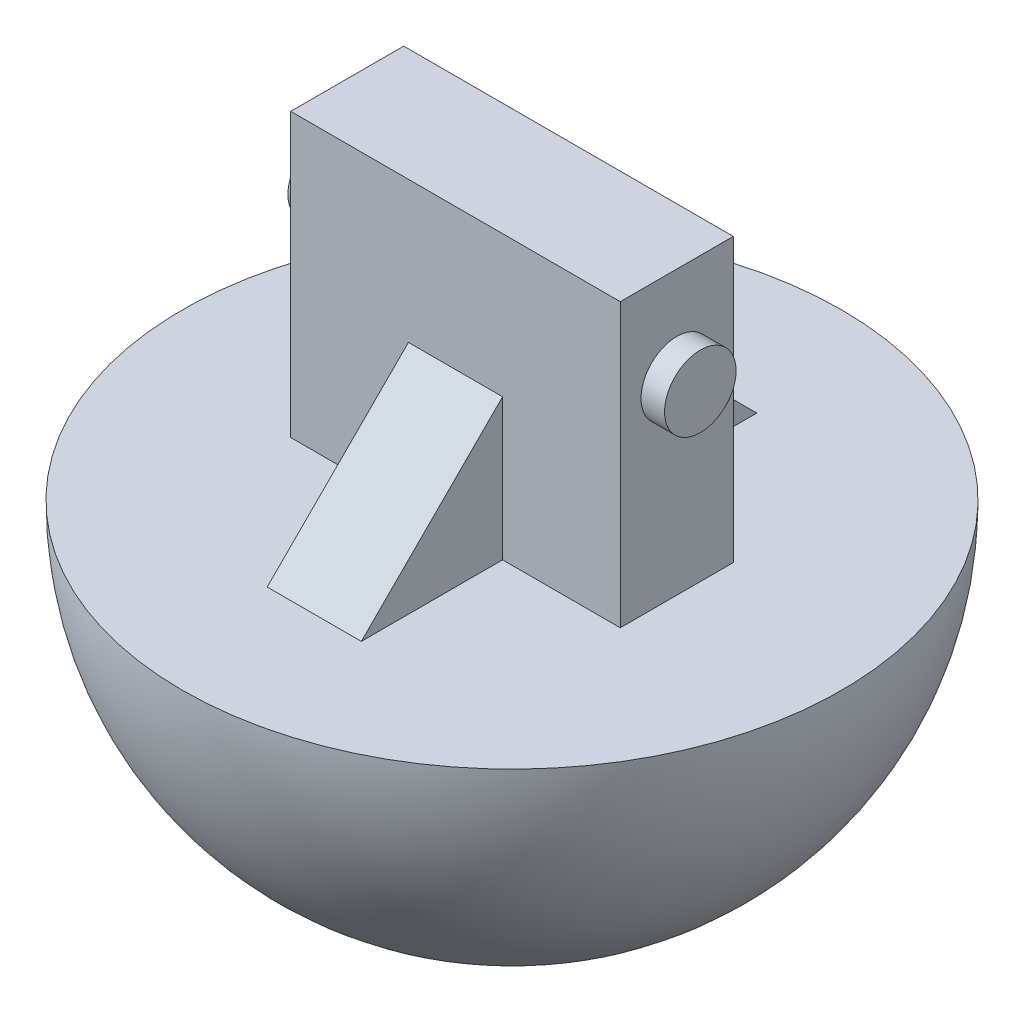
ISO-10303-21;
HEADER;
FILE_DESCRIPTION(('STEP AP214'),'2;1');
FILE_NAME('part.step','',(''),(''),'','','');
FILE_SCHEMA(('AUTOMOTIVE_DESIGN { 1 0 10303 214 1 1 1 1 }'));
ENDSEC;
DATA;
#1=APPLICATION_CONTEXT('core data for automotive mechanical design processes');
#2=APPLICATION_PROTOCOL_DEFINITION('international standard','automotive_design',2000,#1);
#3=PRODUCT_CONTEXT('',#1,'mechanical');
#4=PRODUCT('Part','Part','',(#3));
#5=PRODUCT_RELATED_PRODUCT_CATEGORY('part','',(#4));
#6=PRODUCT_DEFINITION_FORMATION('','',#4);
#7=PRODUCT_DEFINITION_CONTEXT('part definition',#1,'design');
#8=PRODUCT_DEFINITION('design','',#6,#7);
#9=PRODUCT_DEFINITION_SHAPE('','',#8);
#10=(LENGTH_UNIT() NAMED_UNIT(*) SI_UNIT(.MILLI.,.METRE.));
#11=(NAMED_UNIT(*) PLANE_ANGLE_UNIT() SI_UNIT($,.RADIAN.));
#12=(NAMED_UNIT(*) SI_UNIT($,.STERADIAN.) SOLID_ANGLE_UNIT());
#13=UNCERTAINTY_MEASURE_WITH_UNIT(LENGTH_MEASURE(1.E-05),#10,'distance_accuracy_value','');
#14=(GEOMETRIC_REPRESENTATION_CONTEXT(3) GLOBAL_UNCERTAINTY_ASSIGNED_CONTEXT((#13)) GLOBAL_UNIT_ASSIGNED_CONTEXT((#10,
#11,#12)) REPRESENTATION_CONTEXT('',''));
#15=CARTESIAN_POINT('',(0.,0.,0.));
#16=DIRECTION('',(0.,0.,1.));
#17=DIRECTION('',(1.,0.,0.));
#18=AXIS2_PLACEMENT_3D('',#15,#16,#17);
#19=CARTESIAN_POINT('',(0.,-19.05,52.07));
#20=DIRECTION('',(0.,1.,0.));
#21=DIRECTION('',(0.,0.,1.));
#22=AXIS2_PLACEMENT_3D('',#19,#20,#21);
#23=PLANE('',#22);
#24=CARTESIAN_POINT('',(0.,-19.05,7.62));
#25=DIRECTION('',(0.,1.,0.));
#26=DIRECTION('',(0.,0.,1.));
#27=AXIS2_PLACEMENT_3D('',#24,#25,#26);
#28=CIRCLE('',#27,44.45);
#29=CARTESIAN_POINT('',(0.,-19.05,52.07));
#30=VERTEX_POINT('',#29);
#31=EDGE_CURVE('E153',#30,#30,#28,.T.);
#32=ORIENTED_EDGE('',*,*,#31,.T.);
#33=EDGE_LOOP('',(#32));
#34=FACE_BOUND('',#33,.T.);
#35=DIRECTION('',(-1.,0.,0.));
#36=VECTOR('',#35,1.);
#37=CARTESIAN_POINT('',(6.35,-19.05,-19.05));
#38=LINE('',#37,#36);
#39=CARTESIAN_POINT('',(6.35,-19.05,-19.05));
#40=VERTEX_POINT('',#39);
#41=CARTESIAN_POINT('',(-6.35,-19.05,-19.05));
#42=VERTEX_POINT('',#41);
#43=EDGE_CURVE('E48',#40,#42,#38,.T.);
#44=ORIENTED_EDGE('',*,*,#43,.F.);
#45=DIRECTION('',(0.,0.,1.));
#46=VECTOR('',#45,1.);
#47=CARTESIAN_POINT('',(6.35,-19.05,0.));
#48=LINE('',#47,#46);
#49=CARTESIAN_POINT('',(6.35,-19.05,0.));
#50=VERTEX_POINT('',#49);
#51=EDGE_CURVE('E131',#40,#50,#48,.T.);
#52=ORIENTED_EDGE('',*,*,#51,.T.);
#53=DIRECTION('',(1.,0.,0.));
#54=VECTOR('',#53,1.);
#55=CARTESIAN_POINT('',(22.225,-19.05,0.));
#56=LINE('',#55,#54);
#57=CARTESIAN_POINT('',(22.225,-19.05,0.));
#58=VERTEX_POINT('',#57);
#59=EDGE_CURVE('E180',#50,#58,#56,.T.);
#60=ORIENTED_EDGE('',*,*,#59,.T.);
#61=DIRECTION('',(0.,0.,-1.));
#62=VECTOR('',#61,1.);
#63=CARTESIAN_POINT('',(22.225,-19.05,15.24));
#64=LINE('',#63,#62);
#65=CARTESIAN_POINT('',(22.225,-19.05,15.24));
#66=VERTEX_POINT('',#65);
#67=EDGE_CURVE('E191',#66,#58,#64,.T.);
#68=ORIENTED_EDGE('',*,*,#67,.F.);
#69=DIRECTION('',(1.,0.,0.));
#70=VECTOR('',#69,1.);
#71=CARTESIAN_POINT('',(22.225,-19.05,15.24));
#72=LINE('',#71,#70);
#73=CARTESIAN_POINT('',(6.35,-19.05,15.24));
#74=VERTEX_POINT('',#73);
#75=EDGE_CURVE('E168',#74,#66,#72,.T.);
#76=ORIENTED_EDGE('',*,*,#75,.F.);
#77=DIRECTION('',(0.,0.,-1.));
#78=VECTOR('',#77,1.);
#79=CARTESIAN_POINT('',(6.35,-19.05,15.24));
#80=LINE('',#79,#78);
#81=CARTESIAN_POINT('',(6.35,-19.05,34.29));
#82=VERTEX_POINT('',#81);
#83=EDGE_CURVE('E136',#82,#74,#80,.T.);
#84=ORIENTED_EDGE('',*,*,#83,.F.);
#85=DIRECTION('',(-1.,0.,0.));
#86=VECTOR('',#85,1.);
#87=CARTESIAN_POINT('',(6.35,-19.05,34.29));
#88=LINE('',#87,#86);
#89=CARTESIAN_POINT('',(-6.35,-19.05,34.29));
#90=VERTEX_POINT('',#89);
#91=EDGE_CURVE('E151',#82,#90,#88,.T.);
#92=ORIENTED_EDGE('',*,*,#91,.T.);
#93=DIRECTION('',(0.,0.,-1.));
#94=VECTOR('',#93,1.);
#95=CARTESIAN_POINT('',(-6.35,-19.05,15.24));
#96=LINE('',#95,#94);
#97=CARTESIAN_POINT('',(-6.35,-19.05,15.24));
#98=VERTEX_POINT('',#97);
#99=EDGE_CURVE('E146',#90,#98,#96,.T.);
#100=ORIENTED_EDGE('',*,*,#99,.T.);
#101=CARTESIAN_POINT('',(-22.225,-19.05,15.24));
#102=VERTEX_POINT('',#101);
#103=EDGE_CURVE('E170',#102,#98,#72,.T.);
#104=ORIENTED_EDGE('',*,*,#103,.F.);
#105=DIRECTION('',(0.,0.,-1.));
#106=VECTOR('',#105,1.);
#107=CARTESIAN_POINT('',(-22.225,-19.05,15.24));
#108=LINE('',#107,#106);
#109=CARTESIAN_POINT('',(-22.225,-19.05,0.));
#110=VERTEX_POINT('',#109);
#111=EDGE_CURVE('E41',#102,#110,#108,.T.);
#112=ORIENTED_EDGE('',*,*,#111,.T.);
#113=CARTESIAN_POINT('',(-6.35,-19.05,0.));
#114=VERTEX_POINT('',#113);
#115=EDGE_CURVE('E181',#110,#114,#56,.T.);
#116=ORIENTED_EDGE('',*,*,#115,.T.);
#117=DIRECTION('',(0.,0.,1.));
#118=VECTOR('',#117,1.);
#119=CARTESIAN_POINT('',(-6.35,-19.05,0.));
#120=LINE('',#119,#118);
#121=EDGE_CURVE('E53',#42,#114,#120,.T.);
#122=ORIENTED_EDGE('',*,*,#121,.F.);
#123=EDGE_LOOP('',(#44,#52,#60,#68,#76,#84,#92,#100,#104,#112,#116,#122));
#124=FACE_BOUND('',#123,.T.);
#125=ADVANCED_FACE('F33',(#34,#124),#23,.T.);
#126=CARTESIAN_POINT('',(0.,0.,0.));
#127=DIRECTION('',(0.,0.,-1.));
#128=DIRECTION('',(-1.,0.,0.));
#129=AXIS2_PLACEMENT_3D('',#126,#127,#128);
#130=PLANE('',#129);
#131=ORIENTED_EDGE('',*,*,#59,.F.);
#132=DIRECTION('',(0.,1.,0.));
#133=VECTOR('',#132,1.);
#134=CARTESIAN_POINT('',(6.35,0.,0.));
#135=LINE('',#134,#133);
#136=CARTESIAN_POINT('',(6.35,0.,0.));
#137=VERTEX_POINT('',#136);
#138=EDGE_CURVE('E115',#50,#137,#135,.T.);
#139=ORIENTED_EDGE('',*,*,#138,.T.);
#140=DIRECTION('',(-1.,0.,0.));
#141=VECTOR('',#140,1.);
#142=CARTESIAN_POINT('',(6.35,0.,0.));
#143=LINE('',#142,#141);
#144=CARTESIAN_POINT('',(-6.35,0.,0.));
#145=VERTEX_POINT('',#144);
#146=EDGE_CURVE('E108',#137,#145,#143,.T.);
#147=ORIENTED_EDGE('',*,*,#146,.T.);
#148=DIRECTION('',(0.,1.,0.));
#149=VECTOR('',#148,1.);
#150=CARTESIAN_POINT('',(-6.35,0.,0.));
#151=LINE('',#150,#149);
#152=EDGE_CURVE('E113',#114,#145,#151,.T.);
#153=ORIENTED_EDGE('',*,*,#152,.F.);
#154=ORIENTED_EDGE('',*,*,#115,.F.);
#155=DIRECTION('',(0.,-1.,0.));
#156=VECTOR('',#155,1.);
#157=CARTESIAN_POINT('',(-22.225,19.05,0.));
#158=LINE('',#157,#156);
#159=CARTESIAN_POINT('',(-22.225,19.05,0.));
#160=VERTEX_POINT('',#159);
#161=EDGE_CURVE('E165',#160,#110,#158,.T.);
#162=ORIENTED_EDGE('',*,*,#161,.F.);
#163=DIRECTION('',(-1.,0.,0.));
#164=VECTOR('',#163,1.);
#165=CARTESIAN_POINT('',(22.225,19.05,0.));
#166=LINE('',#165,#164);
#167=CARTESIAN_POINT('',(22.225,19.05,0.));
#168=VERTEX_POINT('',#167);
#169=EDGE_CURVE('E169',#168,#160,#166,.T.);
#170=ORIENTED_EDGE('',*,*,#169,.F.);
#171=DIRECTION('',(0.,1.,0.));
#172=VECTOR('',#171,1.);
#173=CARTESIAN_POINT('',(22.225,19.05,0.));
#174=LINE('',#173,#172);
#175=EDGE_CURVE('E183',#58,#168,#174,.T.);
#176=ORIENTED_EDGE('',*,*,#175,.F.);
#177=EDGE_LOOP('',(#131,#139,#147,#153,#154,#162,#170,#176));
#178=FACE_BOUND('',#177,.T.);
#179=ADVANCED_FACE('F111',(#178),#130,.T.);
#180=CARTESIAN_POINT('',(0.,0.,15.24));
#181=DIRECTION('',(0.,0.,-1.));
#182=DIRECTION('',(-1.,0.,0.));
#183=AXIS2_PLACEMENT_3D('',#180,#181,#182);
#184=PLANE('',#183);
#185=DIRECTION('',(0.,1.,0.));
#186=VECTOR('',#185,1.);
#187=CARTESIAN_POINT('',(6.35,0.,15.24));
#188=LINE('',#187,#186);
#189=CARTESIAN_POINT('',(6.35,0.,15.24));
#190=VERTEX_POINT('',#189);
#191=EDGE_CURVE('E140',#74,#190,#188,.T.);
#192=ORIENTED_EDGE('',*,*,#191,.F.);
#193=ORIENTED_EDGE('',*,*,#75,.T.);
#194=DIRECTION('',(0.,1.,0.));
#195=VECTOR('',#194,1.);
#196=CARTESIAN_POINT('',(22.225,19.05,15.24));
#197=LINE('',#196,#195);
#198=CARTESIAN_POINT('',(22.225,19.05,15.24));
#199=VERTEX_POINT('',#198);
#200=EDGE_CURVE('E173',#66,#199,#197,.T.);
#201=ORIENTED_EDGE('',*,*,#200,.T.);
#202=DIRECTION('',(-1.,0.,0.));
#203=VECTOR('',#202,1.);
#204=CARTESIAN_POINT('',(22.225,19.05,15.24));
#205=LINE('',#204,#203);
#206=CARTESIAN_POINT('',(-22.225,19.05,15.24));
#207=VERTEX_POINT('',#206);
#208=EDGE_CURVE('E175',#199,#207,#205,.T.);
#209=ORIENTED_EDGE('',*,*,#208,.T.);
#210=DIRECTION('',(0.,-1.,0.));
#211=VECTOR('',#210,1.);
#212=CARTESIAN_POINT('',(-22.225,19.05,15.24));
#213=LINE('',#212,#211);
#214=EDGE_CURVE('E166',#207,#102,#213,.T.);
#215=ORIENTED_EDGE('',*,*,#214,.T.);
#216=ORIENTED_EDGE('',*,*,#103,.T.);
#217=DIRECTION('',(0.,1.,0.));
#218=VECTOR('',#217,1.);
#219=CARTESIAN_POINT('',(-6.35,0.,15.24));
#220=LINE('',#219,#218);
#221=CARTESIAN_POINT('',(-6.35,0.,15.24));
#222=VERTEX_POINT('',#221);
#223=EDGE_CURVE('E137',#98,#222,#220,.T.);
#224=ORIENTED_EDGE('',*,*,#223,.T.);
#225=DIRECTION('',(-1.,0.,0.));
#226=VECTOR('',#225,1.);
#227=CARTESIAN_POINT('',(6.35,0.,15.24));
#228=LINE('',#227,#226);
#229=EDGE_CURVE('E143',#190,#222,#228,.T.);
#230=ORIENTED_EDGE('',*,*,#229,.F.);
#231=EDGE_LOOP('',(#192,#193,#201,#209,#215,#216,#224,#230));
#232=FACE_BOUND('',#231,.T.);
#233=ADVANCED_FACE('F231',(#232),#184,.F.);
#234=CARTESIAN_POINT('',(-22.225,19.05,15.24));
#235=DIRECTION('',(1.,0.,0.));
#236=DIRECTION('',(0.,1.,0.));
#237=AXIS2_PLACEMENT_3D('',#234,#235,#236);
#238=PLANE('',#237);
#239=CARTESIAN_POINT('',(-22.225,6.35,7.62));
#240=DIRECTION('',(1.,0.,0.));
#241=DIRECTION('',(0.,1.,0.));
#242=AXIS2_PLACEMENT_3D('',#239,#240,#241);
#243=CIRCLE('',#242,4.826);
#244=CARTESIAN_POINT('',(-22.225,11.176,7.62));
#245=VERTEX_POINT('',#244);
#246=EDGE_CURVE('E156',#245,#245,#243,.T.);
#247=ORIENTED_EDGE('',*,*,#246,.T.);
#248=EDGE_LOOP('',(#247));
#249=FACE_BOUND('',#248,.T.);
#250=ORIENTED_EDGE('',*,*,#161,.T.);
#251=ORIENTED_EDGE('',*,*,#111,.F.);
#252=ORIENTED_EDGE('',*,*,#214,.F.);
#253=DIRECTION('',(0.,0.,-1.));
#254=VECTOR('',#253,1.);
#255=CARTESIAN_POINT('',(-22.225,19.05,15.24));
#256=LINE('',#255,#254);
#257=EDGE_CURVE('E177',#207,#160,#256,.T.);
#258=ORIENTED_EDGE('',*,*,#257,.T.);
#259=EDGE_LOOP('',(#250,#251,#252,#258));
#260=FACE_BOUND('',#259,.T.);
#261=ADVANCED_FACE('F35',(#249,#260),#238,.F.);
#262=CARTESIAN_POINT('',(22.225,19.05,15.24));
#263=DIRECTION('',(-1.,0.,0.));
#264=DIRECTION('',(0.,-1.,0.));
#265=AXIS2_PLACEMENT_3D('',#262,#263,#264);
#266=PLANE('',#265);
#267=CARTESIAN_POINT('',(22.225,6.35,7.62));
#268=DIRECTION('',(-1.,0.,0.));
#269=DIRECTION('',(0.,-1.,0.));
#270=AXIS2_PLACEMENT_3D('',#267,#268,#269);
#271=CIRCLE('',#270,4.826);
#272=CARTESIAN_POINT('',(22.225,1.524,7.62));
#273=VERTEX_POINT('',#272);
#274=EDGE_CURVE('E11',#273,#273,#271,.F.);
#275=ORIENTED_EDGE('',*,*,#274,.F.);
#276=EDGE_LOOP('',(#275));
#277=FACE_BOUND('',#276,.T.);
#278=ORIENTED_EDGE('',*,*,#175,.T.);
#279=DIRECTION('',(0.,0.,-1.));
#280=VECTOR('',#279,1.);
#281=CARTESIAN_POINT('',(22.225,19.05,15.24));
#282=LINE('',#281,#280);
#283=EDGE_CURVE('E188',#199,#168,#282,.T.);
#284=ORIENTED_EDGE('',*,*,#283,.F.);
#285=ORIENTED_EDGE('',*,*,#200,.F.);
#286=ORIENTED_EDGE('',*,*,#67,.T.);
#287=EDGE_LOOP('',(#278,#284,#285,#286));
#288=FACE_BOUND('',#287,.T.);
#289=ADVANCED_FACE('F208',(#277,#288),#266,.F.);
#290=CARTESIAN_POINT('',(22.225,19.05,15.24));
#291=DIRECTION('',(0.,-1.,0.));
#292=DIRECTION('',(1.,0.,0.));
#293=AXIS2_PLACEMENT_3D('',#290,#291,#292);
#294=PLANE('',#293);
#295=ORIENTED_EDGE('',*,*,#169,.T.);
#296=ORIENTED_EDGE('',*,*,#257,.F.);
#297=ORIENTED_EDGE('',*,*,#208,.F.);
#298=ORIENTED_EDGE('',*,*,#283,.T.);
#299=EDGE_LOOP('',(#295,#296,#297,#298));
#300=FACE_BOUND('',#299,.T.);
#301=ADVANCED_FACE('F203',(#300),#294,.F.);
#302=CARTESIAN_POINT('',(25.4,6.35,7.62));
#303=DIRECTION('',(-1.,0.,0.));
#304=DIRECTION('',(0.,-1.,0.));
#305=AXIS2_PLACEMENT_3D('',#302,#303,#304);
#306=CYLINDRICAL_SURFACE('',#305,4.826);
#307=CARTESIAN_POINT('',(25.4,6.35,7.62));
#308=DIRECTION('',(1.,0.,0.));
#309=DIRECTION('',(0.,1.,0.));
#310=AXIS2_PLACEMENT_3D('',#307,#308,#309);
#311=CIRCLE('',#310,4.826);
#312=CARTESIAN_POINT('',(25.4,11.176,7.62));
#313=VERTEX_POINT('',#312);
#314=EDGE_CURVE('E160',#313,#313,#311,.T.);
#315=ORIENTED_EDGE('',*,*,#314,.F.);
#316=EDGE_LOOP('',(#315));
#317=FACE_BOUND('',#316,.T.);
#318=ORIENTED_EDGE('',*,*,#274,.T.);
#319=EDGE_LOOP('',(#318));
#320=FACE_BOUND('',#319,.T.);
#321=ADVANCED_FACE('F252',(#317,#320),#306,.T.);
#322=CARTESIAN_POINT('',(25.4,6.35,7.62));
#323=DIRECTION('',(1.,0.,0.));
#324=DIRECTION('',(0.,1.,0.));
#325=AXIS2_PLACEMENT_3D('',#322,#323,#324);
#326=PLANE('',#325);
#327=ORIENTED_EDGE('',*,*,#314,.T.);
#328=EDGE_LOOP('',(#327));
#329=FACE_BOUND('',#328,.T.);
#330=ADVANCED_FACE('F248',(#329),#326,.T.);
#331=CARTESIAN_POINT('',(-25.4,6.35,7.62));
#332=DIRECTION('',(1.,0.,0.));
#333=DIRECTION('',(0.,1.,0.));
#334=AXIS2_PLACEMENT_3D('',#331,#332,#333);
#335=CYLINDRICAL_SURFACE('',#334,4.826);
#336=CARTESIAN_POINT('',(-25.4,6.35,7.62));
#337=DIRECTION('',(1.,0.,0.));
#338=DIRECTION('',(0.,1.,0.));
#339=AXIS2_PLACEMENT_3D('',#336,#337,#338);
#340=CIRCLE('',#339,4.826);
#341=CARTESIAN_POINT('',(-25.4,11.176,7.62));
#342=VERTEX_POINT('',#341);
#343=EDGE_CURVE('E157',#342,#342,#340,.T.);
#344=ORIENTED_EDGE('',*,*,#343,.T.);
#345=EDGE_LOOP('',(#344));
#346=FACE_BOUND('',#345,.T.);
#347=ORIENTED_EDGE('',*,*,#246,.F.);
#348=EDGE_LOOP('',(#347));
#349=FACE_BOUND('',#348,.T.);
#350=ADVANCED_FACE('F244',(#346,#349),#335,.T.);
#351=CARTESIAN_POINT('',(-25.4,6.35,7.62));
#352=DIRECTION('',(-1.,0.,0.));
#353=DIRECTION('',(0.,1.,0.));
#354=AXIS2_PLACEMENT_3D('',#351,#352,#353);
#355=PLANE('',#354);
#356=ORIENTED_EDGE('',*,*,#343,.F.);
#357=EDGE_LOOP('',(#356));
#358=FACE_BOUND('',#357,.T.);
#359=ADVANCED_FACE('F240',(#358),#355,.T.);
#360=CARTESIAN_POINT('',(0.,-19.05,7.62));
#361=DIRECTION('',(0.,1.,0.));
#362=DIRECTION('',(0.,0.,1.));
#363=AXIS2_PLACEMENT_3D('',#360,#361,#362);
#364=SPHERICAL_SURFACE('',#363,44.45);
#365=ORIENTED_EDGE('',*,*,#31,.F.);
#366=EDGE_LOOP('',(#365));
#367=FACE_BOUND('',#366,.T.);
#368=ADVANCED_FACE('F237',(#367),#364,.T.);
#369=CARTESIAN_POINT('',(6.35,-19.05,34.29));
#370=DIRECTION('',(0.,-0.707106781186548,-0.707106781186547));
#371=DIRECTION('',(0.,0.707106781186547,-0.707106781186548));
#372=AXIS2_PLACEMENT_3D('',#369,#370,#371);
#373=PLANE('',#372);
#374=DIRECTION('',(0.,-0.707106781186547,0.707106781186548));
#375=VECTOR('',#374,1.);
#376=CARTESIAN_POINT('',(-6.35,-19.05,34.29));
#377=LINE('',#376,#375);
#378=EDGE_CURVE('E118',#222,#90,#377,.T.);
#379=ORIENTED_EDGE('',*,*,#378,.T.);
#380=ORIENTED_EDGE('',*,*,#91,.F.);
#381=DIRECTION('',(0.,-0.707106781186547,0.707106781186548));
#382=VECTOR('',#381,1.);
#383=CARTESIAN_POINT('',(6.35,-19.05,34.29));
#384=LINE('',#383,#382);
#385=EDGE_CURVE('E133',#190,#82,#384,.T.);
#386=ORIENTED_EDGE('',*,*,#385,.F.);
#387=ORIENTED_EDGE('',*,*,#229,.T.);
#388=EDGE_LOOP('',(#379,#380,#386,#387));
#389=FACE_BOUND('',#388,.T.);
#390=ADVANCED_FACE('F235',(#389),#373,.F.);
#391=CARTESIAN_POINT('',(6.35,0.,0.));
#392=DIRECTION('',(-1.,0.,0.));
#393=DIRECTION('',(0.,0.,1.));
#394=AXIS2_PLACEMENT_3D('',#391,#392,#393);
#395=PLANE('',#394);
#396=ORIENTED_EDGE('',*,*,#385,.T.);
#397=ORIENTED_EDGE('',*,*,#83,.T.);
#398=ORIENTED_EDGE('',*,*,#191,.T.);
#399=EDGE_LOOP('',(#396,#397,#398));
#400=FACE_BOUND('',#399,.T.);
#401=ADVANCED_FACE('F311',(#400),#395,.F.);
#402=CARTESIAN_POINT('',(-6.35,0.,0.));
#403=DIRECTION('',(-1.,0.,0.));
#404=DIRECTION('',(0.,0.,1.));
#405=AXIS2_PLACEMENT_3D('',#402,#403,#404);
#406=PLANE('',#405);
#407=ORIENTED_EDGE('',*,*,#378,.F.);
#408=ORIENTED_EDGE('',*,*,#223,.F.);
#409=ORIENTED_EDGE('',*,*,#99,.F.);
#410=EDGE_LOOP('',(#407,#408,#409));
#411=FACE_BOUND('',#410,.T.);
#412=ADVANCED_FACE('F223',(#411),#406,.T.);
#413=CARTESIAN_POINT('',(6.35,-19.05,-19.05));
#414=DIRECTION('',(0.,0.707106781186548,-0.707106781186547));
#415=DIRECTION('',(0.,0.707106781186547,0.707106781186548));
#416=AXIS2_PLACEMENT_3D('',#413,#414,#415);
#417=PLANE('',#416);
#418=DIRECTION('',(0.,-0.707106781186547,-0.707106781186548));
#419=VECTOR('',#418,1.);
#420=CARTESIAN_POINT('',(-6.35,-19.05,-19.05));
#421=LINE('',#420,#419);
#422=EDGE_CURVE('E121',#145,#42,#421,.T.);
#423=ORIENTED_EDGE('',*,*,#422,.F.);
#424=ORIENTED_EDGE('',*,*,#146,.F.);
#425=DIRECTION('',(0.,-0.707106781186547,-0.707106781186548));
#426=VECTOR('',#425,1.);
#427=CARTESIAN_POINT('',(6.35,-19.05,-19.05));
#428=LINE('',#427,#426);
#429=EDGE_CURVE('E127',#137,#40,#428,.T.);
#430=ORIENTED_EDGE('',*,*,#429,.T.);
#431=ORIENTED_EDGE('',*,*,#43,.T.);
#432=EDGE_LOOP('',(#423,#424,#430,#431));
#433=FACE_BOUND('',#432,.T.);
#434=ADVANCED_FACE('F122',(#433),#417,.T.);
#435=CARTESIAN_POINT('',(6.35,0.,15.24));
#436=DIRECTION('',(-1.,0.,0.));
#437=DIRECTION('',(0.,0.,-1.));
#438=AXIS2_PLACEMENT_3D('',#435,#436,#437);
#439=PLANE('',#438);
#440=ORIENTED_EDGE('',*,*,#429,.F.);
#441=ORIENTED_EDGE('',*,*,#138,.F.);
#442=ORIENTED_EDGE('',*,*,#51,.F.);
#443=EDGE_LOOP('',(#440,#441,#442));
#444=FACE_BOUND('',#443,.T.);
#445=ADVANCED_FACE('F213',(#444),#439,.F.);
#446=CARTESIAN_POINT('',(-6.35,0.,15.24));
#447=DIRECTION('',(-1.,0.,0.));
#448=DIRECTION('',(0.,0.,-1.));
#449=AXIS2_PLACEMENT_3D('',#446,#447,#448);
#450=PLANE('',#449);
#451=ORIENTED_EDGE('',*,*,#422,.T.);
#452=ORIENTED_EDGE('',*,*,#121,.T.);
#453=ORIENTED_EDGE('',*,*,#152,.T.);
#454=EDGE_LOOP('',(#451,#452,#453));
#455=FACE_BOUND('',#454,.T.);
#456=ADVANCED_FACE('F125',(#455),#450,.T.);
#457=CLOSED_SHELL('',(#125,#179,#233,#261,#289,#301,#321,#330,#350,#359,#368,#390,#401,#412,
#434,#445,#456));
#458=MANIFOLD_SOLID_BREP('B2',#457);
#459=ADVANCED_BREP_SHAPE_REPRESENTATION('',(#18,#458),#14);
#460=SHAPE_DEFINITION_REPRESENTATION(#9,#459);
ENDSEC;
END-ISO-10303-21;
